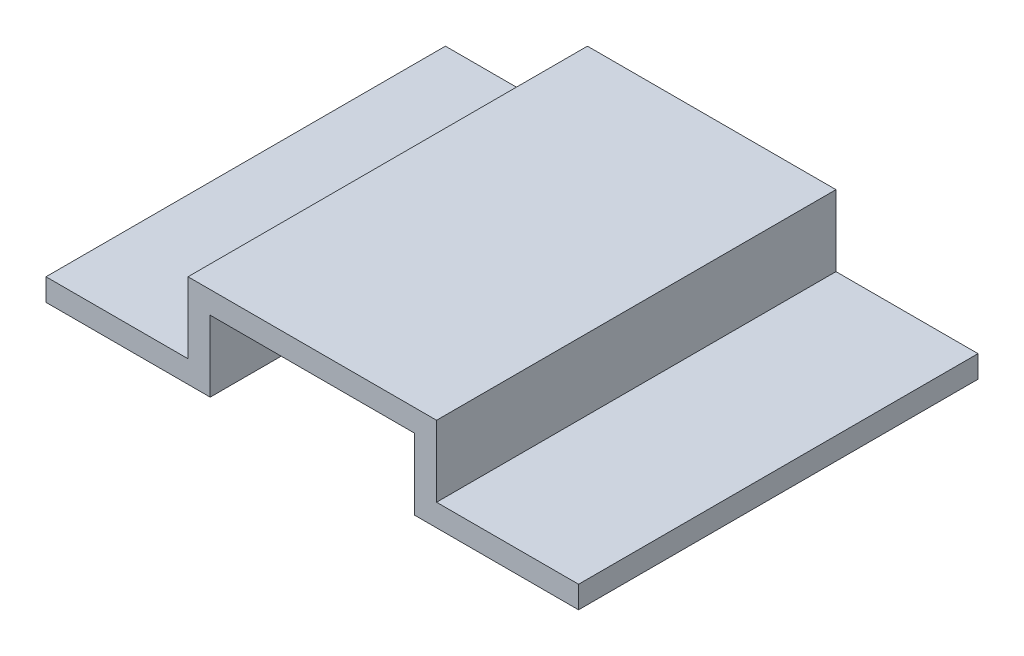
ISO-10303-21;
HEADER;
FILE_DESCRIPTION(('STEP AP214'),'2;1');
FILE_NAME('part.step','',(''),(''),'','','');
FILE_SCHEMA(('AUTOMOTIVE_DESIGN { 1 0 10303 214 1 1 1 1 }'));
ENDSEC;
DATA;
#1=APPLICATION_CONTEXT('core data for automotive mechanical design processes');
#2=APPLICATION_PROTOCOL_DEFINITION('international standard','automotive_design',2000,#1);
#3=PRODUCT_CONTEXT('',#1,'mechanical');
#4=PRODUCT('Part','Part','',(#3));
#5=PRODUCT_RELATED_PRODUCT_CATEGORY('part','',(#4));
#6=PRODUCT_DEFINITION_FORMATION('','',#4);
#7=PRODUCT_DEFINITION_CONTEXT('part definition',#1,'design');
#8=PRODUCT_DEFINITION('design','',#6,#7);
#9=PRODUCT_DEFINITION_SHAPE('','',#8);
#10=(LENGTH_UNIT() NAMED_UNIT(*) SI_UNIT(.MILLI.,.METRE.));
#11=(NAMED_UNIT(*) PLANE_ANGLE_UNIT() SI_UNIT($,.RADIAN.));
#12=(NAMED_UNIT(*) SI_UNIT($,.STERADIAN.) SOLID_ANGLE_UNIT());
#13=UNCERTAINTY_MEASURE_WITH_UNIT(LENGTH_MEASURE(1.E-05),#10,'distance_accuracy_value','');
#14=(GEOMETRIC_REPRESENTATION_CONTEXT(3) GLOBAL_UNCERTAINTY_ASSIGNED_CONTEXT((#13)) GLOBAL_UNIT_ASSIGNED_CONTEXT((#10,
#11,#12)) REPRESENTATION_CONTEXT('',''));
#15=CARTESIAN_POINT('',(0.,0.,0.));
#16=DIRECTION('',(0.,0.,1.));
#17=DIRECTION('',(1.,0.,0.));
#18=AXIS2_PLACEMENT_3D('',#15,#16,#17);
#19=CARTESIAN_POINT('',(210.,25.,450.));
#20=DIRECTION('',(-1.,0.,0.));
#21=DIRECTION('',(0.,-1.,0.));
#22=AXIS2_PLACEMENT_3D('',#19,#20,#21);
#23=PLANE('',#22);
#24=DIRECTION('',(0.,1.,0.));
#25=VECTOR('',#24,1.);
#26=CARTESIAN_POINT('',(210.,25.,0.));
#27=LINE('',#26,#25);
#28=CARTESIAN_POINT('',(210.,25.,0.));
#29=VERTEX_POINT('',#28);
#30=CARTESIAN_POINT('',(210.,105.,0.));
#31=VERTEX_POINT('',#30);
#32=EDGE_CURVE('E157',#29,#31,#27,.T.);
#33=ORIENTED_EDGE('',*,*,#32,.F.);
#34=DIRECTION('',(0.,0.,-1.));
#35=VECTOR('',#34,1.);
#36=CARTESIAN_POINT('',(210.,25.,450.));
#37=LINE('',#36,#35);
#38=CARTESIAN_POINT('',(210.,25.,450.));
#39=VERTEX_POINT('',#38);
#40=EDGE_CURVE('E11',#39,#29,#37,.T.);
#41=ORIENTED_EDGE('',*,*,#40,.F.);
#42=DIRECTION('',(0.,1.,0.));
#43=VECTOR('',#42,1.);
#44=CARTESIAN_POINT('',(210.,25.,450.));
#45=LINE('',#44,#43);
#46=CARTESIAN_POINT('',(210.,105.,450.));
#47=VERTEX_POINT('',#46);
#48=EDGE_CURVE('E187',#39,#47,#45,.T.);
#49=ORIENTED_EDGE('',*,*,#48,.T.);
#50=DIRECTION('',(0.,0.,-1.));
#51=VECTOR('',#50,1.);
#52=CARTESIAN_POINT('',(210.,105.,450.));
#53=LINE('',#52,#51);
#54=EDGE_CURVE('E40',#47,#31,#53,.T.);
#55=ORIENTED_EDGE('',*,*,#54,.T.);
#56=EDGE_LOOP('',(#33,#41,#49,#55));
#57=FACE_BOUND('',#56,.T.);
#58=ADVANCED_FACE('F37',(#57),#23,.T.);
#59=CARTESIAN_POINT('',(50.,25.,450.));
#60=DIRECTION('',(0.,1.,0.));
#61=DIRECTION('',(0.,0.,1.));
#62=AXIS2_PLACEMENT_3D('',#59,#60,#61);
#63=PLANE('',#62);
#64=DIRECTION('',(1.,0.,0.));
#65=VECTOR('',#64,1.);
#66=CARTESIAN_POINT('',(50.,25.,0.));
#67=LINE('',#66,#65);
#68=CARTESIAN_POINT('',(50.,25.,0.));
#69=VERTEX_POINT('',#68);
#70=EDGE_CURVE('E185',#69,#29,#67,.T.);
#71=ORIENTED_EDGE('',*,*,#70,.F.);
#72=DIRECTION('',(0.,0.,-1.));
#73=VECTOR('',#72,1.);
#74=CARTESIAN_POINT('',(50.,25.,450.));
#75=LINE('',#74,#73);
#76=CARTESIAN_POINT('',(50.,25.,450.));
#77=VERTEX_POINT('',#76);
#78=EDGE_CURVE('E46',#77,#69,#75,.T.);
#79=ORIENTED_EDGE('',*,*,#78,.F.);
#80=DIRECTION('',(1.,0.,0.));
#81=VECTOR('',#80,1.);
#82=CARTESIAN_POINT('',(50.,25.,450.));
#83=LINE('',#82,#81);
#84=EDGE_CURVE('E137',#77,#39,#83,.T.);
#85=ORIENTED_EDGE('',*,*,#84,.T.);
#86=ORIENTED_EDGE('',*,*,#40,.T.);
#87=EDGE_LOOP('',(#71,#79,#85,#86));
#88=FACE_BOUND('',#87,.T.);
#89=ADVANCED_FACE('F210',(#88),#63,.T.);
#90=CARTESIAN_POINT('',(50.,25.,450.));
#91=DIRECTION('',(1.,0.,0.));
#92=DIRECTION('',(0.,0.,-1.));
#93=AXIS2_PLACEMENT_3D('',#90,#91,#92);
#94=PLANE('',#93);
#95=DIRECTION('',(0.,-1.,0.));
#96=VECTOR('',#95,1.);
#97=CARTESIAN_POINT('',(50.,25.,0.));
#98=LINE('',#97,#96);
#99=CARTESIAN_POINT('',(50.,0.,0.));
#100=VERTEX_POINT('',#99);
#101=EDGE_CURVE('E142',#69,#100,#98,.T.);
#102=ORIENTED_EDGE('',*,*,#101,.T.);
#103=DIRECTION('',(0.,0.,-1.));
#104=VECTOR('',#103,1.);
#105=CARTESIAN_POINT('',(50.,0.,450.));
#106=LINE('',#105,#104);
#107=CARTESIAN_POINT('',(50.,0.,450.));
#108=VERTEX_POINT('',#107);
#109=EDGE_CURVE('E140',#108,#100,#106,.T.);
#110=ORIENTED_EDGE('',*,*,#109,.F.);
#111=DIRECTION('',(0.,-1.,0.));
#112=VECTOR('',#111,1.);
#113=CARTESIAN_POINT('',(50.,25.,450.));
#114=LINE('',#113,#112);
#115=EDGE_CURVE('E131',#77,#108,#114,.T.);
#116=ORIENTED_EDGE('',*,*,#115,.F.);
#117=ORIENTED_EDGE('',*,*,#78,.T.);
#118=EDGE_LOOP('',(#102,#110,#116,#117));
#119=FACE_BOUND('',#118,.T.);
#120=ADVANCED_FACE('F141',(#119),#94,.F.);
#121=CARTESIAN_POINT('',(50.,0.,450.));
#122=DIRECTION('',(0.,1.,0.));
#123=DIRECTION('',(0.,0.,1.));
#124=AXIS2_PLACEMENT_3D('',#121,#122,#123);
#125=PLANE('',#124);
#126=DIRECTION('',(1.,0.,0.));
#127=VECTOR('',#126,1.);
#128=CARTESIAN_POINT('',(50.,0.,0.));
#129=LINE('',#128,#127);
#130=CARTESIAN_POINT('',(235.,0.,0.));
#131=VERTEX_POINT('',#130);
#132=EDGE_CURVE('E182',#100,#131,#129,.T.);
#133=ORIENTED_EDGE('',*,*,#132,.T.);
#134=DIRECTION('',(0.,0.,-1.));
#135=VECTOR('',#134,1.);
#136=CARTESIAN_POINT('',(235.,0.,450.));
#137=LINE('',#136,#135);
#138=CARTESIAN_POINT('',(235.,0.,450.));
#139=VERTEX_POINT('',#138);
#140=EDGE_CURVE('E145',#139,#131,#137,.T.);
#141=ORIENTED_EDGE('',*,*,#140,.F.);
#142=DIRECTION('',(1.,0.,0.));
#143=VECTOR('',#142,1.);
#144=CARTESIAN_POINT('',(50.,0.,450.));
#145=LINE('',#144,#143);
#146=EDGE_CURVE('E135',#108,#139,#145,.T.);
#147=ORIENTED_EDGE('',*,*,#146,.F.);
#148=ORIENTED_EDGE('',*,*,#109,.T.);
#149=EDGE_LOOP('',(#133,#141,#147,#148));
#150=FACE_BOUND('',#149,.T.);
#151=ADVANCED_FACE('F147',(#150),#125,.F.);
#152=CARTESIAN_POINT('',(235.,0.,450.));
#153=DIRECTION('',(-1.,0.,0.));
#154=DIRECTION('',(0.,0.,1.));
#155=AXIS2_PLACEMENT_3D('',#152,#153,#154);
#156=PLANE('',#155);
#157=DIRECTION('',(0.,1.,0.));
#158=VECTOR('',#157,1.);
#159=CARTESIAN_POINT('',(235.,0.,0.));
#160=LINE('',#159,#158);
#161=CARTESIAN_POINT('',(235.,80.,0.));
#162=VERTEX_POINT('',#161);
#163=EDGE_CURVE('E180',#131,#162,#160,.T.);
#164=ORIENTED_EDGE('',*,*,#163,.T.);
#165=DIRECTION('',(0.,0.,-1.));
#166=VECTOR('',#165,1.);
#167=CARTESIAN_POINT('',(235.,80.,450.));
#168=LINE('',#167,#166);
#169=CARTESIAN_POINT('',(235.,80.,450.));
#170=VERTEX_POINT('',#169);
#171=EDGE_CURVE('E191',#170,#162,#168,.T.);
#172=ORIENTED_EDGE('',*,*,#171,.F.);
#173=DIRECTION('',(0.,1.,0.));
#174=VECTOR('',#173,1.);
#175=CARTESIAN_POINT('',(235.,0.,450.));
#176=LINE('',#175,#174);
#177=EDGE_CURVE('E150',#139,#170,#176,.T.);
#178=ORIENTED_EDGE('',*,*,#177,.F.);
#179=ORIENTED_EDGE('',*,*,#140,.T.);
#180=EDGE_LOOP('',(#164,#172,#178,#179));
#181=FACE_BOUND('',#180,.T.);
#182=ADVANCED_FACE('F223',(#181),#156,.F.);
#183=CARTESIAN_POINT('',(235.,80.,450.));
#184=DIRECTION('',(0.,1.,0.));
#185=DIRECTION('',(0.,0.,1.));
#186=AXIS2_PLACEMENT_3D('',#183,#184,#185);
#187=PLANE('',#186);
#188=DIRECTION('',(1.,0.,0.));
#189=VECTOR('',#188,1.);
#190=CARTESIAN_POINT('',(235.,80.,0.));
#191=LINE('',#190,#189);
#192=CARTESIAN_POINT('',(465.,80.,0.));
#193=VERTEX_POINT('',#192);
#194=EDGE_CURVE('E177',#162,#193,#191,.T.);
#195=ORIENTED_EDGE('',*,*,#194,.T.);
#196=DIRECTION('',(0.,0.,-1.));
#197=VECTOR('',#196,1.);
#198=CARTESIAN_POINT('',(465.,80.,450.));
#199=LINE('',#198,#197);
#200=CARTESIAN_POINT('',(465.,80.,450.));
#201=VERTEX_POINT('',#200);
#202=EDGE_CURVE('E194',#201,#193,#199,.T.);
#203=ORIENTED_EDGE('',*,*,#202,.F.);
#204=DIRECTION('',(1.,0.,0.));
#205=VECTOR('',#204,1.);
#206=CARTESIAN_POINT('',(235.,80.,450.));
#207=LINE('',#206,#205);
#208=EDGE_CURVE('E152',#170,#201,#207,.T.);
#209=ORIENTED_EDGE('',*,*,#208,.F.);
#210=ORIENTED_EDGE('',*,*,#171,.T.);
#211=EDGE_LOOP('',(#195,#203,#209,#210));
#212=FACE_BOUND('',#211,.T.);
#213=ADVANCED_FACE('F226',(#212),#187,.F.);
#214=CARTESIAN_POINT('',(465.,0.,450.));
#215=DIRECTION('',(-1.,0.,0.));
#216=DIRECTION('',(0.,0.,1.));
#217=AXIS2_PLACEMENT_3D('',#214,#215,#216);
#218=PLANE('',#217);
#219=DIRECTION('',(0.,1.,0.));
#220=VECTOR('',#219,1.);
#221=CARTESIAN_POINT('',(465.,0.,0.));
#222=LINE('',#221,#220);
#223=CARTESIAN_POINT('',(465.,0.,0.));
#224=VERTEX_POINT('',#223);
#225=EDGE_CURVE('E174',#224,#193,#222,.T.);
#226=ORIENTED_EDGE('',*,*,#225,.F.);
#227=DIRECTION('',(0.,0.,-1.));
#228=VECTOR('',#227,1.);
#229=CARTESIAN_POINT('',(465.,0.,450.));
#230=LINE('',#229,#228);
#231=CARTESIAN_POINT('',(465.,0.,450.));
#232=VERTEX_POINT('',#231);
#233=EDGE_CURVE('E196',#232,#224,#230,.T.);
#234=ORIENTED_EDGE('',*,*,#233,.F.);
#235=DIRECTION('',(0.,1.,0.));
#236=VECTOR('',#235,1.);
#237=CARTESIAN_POINT('',(465.,0.,450.));
#238=LINE('',#237,#236);
#239=EDGE_CURVE('E352',#232,#201,#238,.T.);
#240=ORIENTED_EDGE('',*,*,#239,.T.);
#241=ORIENTED_EDGE('',*,*,#202,.T.);
#242=EDGE_LOOP('',(#226,#234,#240,#241));
#243=FACE_BOUND('',#242,.T.);
#244=ADVANCED_FACE('F230',(#243),#218,.T.);
#245=CARTESIAN_POINT('',(650.,0.,450.));
#246=DIRECTION('',(0.,-1.,0.));
#247=DIRECTION('',(0.,0.,-1.));
#248=AXIS2_PLACEMENT_3D('',#245,#246,#247);
#249=PLANE('',#248);
#250=DIRECTION('',(-1.,0.,0.));
#251=VECTOR('',#250,1.);
#252=CARTESIAN_POINT('',(650.,0.,0.));
#253=LINE('',#252,#251);
#254=CARTESIAN_POINT('',(650.,0.,0.));
#255=VERTEX_POINT('',#254);
#256=EDGE_CURVE('E171',#255,#224,#253,.T.);
#257=ORIENTED_EDGE('',*,*,#256,.F.);
#258=DIRECTION('',(0.,0.,-1.));
#259=VECTOR('',#258,1.);
#260=CARTESIAN_POINT('',(650.,0.,450.));
#261=LINE('',#260,#259);
#262=CARTESIAN_POINT('',(650.,0.,450.));
#263=VERTEX_POINT('',#262);
#264=EDGE_CURVE('E198',#263,#255,#261,.T.);
#265=ORIENTED_EDGE('',*,*,#264,.F.);
#266=DIRECTION('',(-1.,0.,0.));
#267=VECTOR('',#266,1.);
#268=CARTESIAN_POINT('',(650.,0.,450.));
#269=LINE('',#268,#267);
#270=EDGE_CURVE('E355',#263,#232,#269,.T.);
#271=ORIENTED_EDGE('',*,*,#270,.T.);
#272=ORIENTED_EDGE('',*,*,#233,.T.);
#273=EDGE_LOOP('',(#257,#265,#271,#272));
#274=FACE_BOUND('',#273,.T.);
#275=ADVANCED_FACE('F234',(#274),#249,.T.);
#276=CARTESIAN_POINT('',(650.,25.,450.));
#277=DIRECTION('',(1.,0.,0.));
#278=DIRECTION('',(0.,0.,-1.));
#279=AXIS2_PLACEMENT_3D('',#276,#277,#278);
#280=PLANE('',#279);
#281=DIRECTION('',(0.,-1.,0.));
#282=VECTOR('',#281,1.);
#283=CARTESIAN_POINT('',(650.,25.,0.));
#284=LINE('',#283,#282);
#285=CARTESIAN_POINT('',(650.,25.,0.));
#286=VERTEX_POINT('',#285);
#287=EDGE_CURVE('E168',#286,#255,#284,.T.);
#288=ORIENTED_EDGE('',*,*,#287,.F.);
#289=DIRECTION('',(0.,0.,-1.));
#290=VECTOR('',#289,1.);
#291=CARTESIAN_POINT('',(650.,25.,450.));
#292=LINE('',#291,#290);
#293=CARTESIAN_POINT('',(650.,25.,450.));
#294=VERTEX_POINT('',#293);
#295=EDGE_CURVE('E200',#294,#286,#292,.T.);
#296=ORIENTED_EDGE('',*,*,#295,.F.);
#297=DIRECTION('',(0.,-1.,0.));
#298=VECTOR('',#297,1.);
#299=CARTESIAN_POINT('',(650.,25.,450.));
#300=LINE('',#299,#298);
#301=EDGE_CURVE('E343',#294,#263,#300,.T.);
#302=ORIENTED_EDGE('',*,*,#301,.T.);
#303=ORIENTED_EDGE('',*,*,#264,.T.);
#304=EDGE_LOOP('',(#288,#296,#302,#303));
#305=FACE_BOUND('',#304,.T.);
#306=ADVANCED_FACE('F238',(#305),#280,.T.);
#307=CARTESIAN_POINT('',(650.,25.,450.));
#308=DIRECTION('',(0.,-1.,0.));
#309=DIRECTION('',(0.,0.,-1.));
#310=AXIS2_PLACEMENT_3D('',#307,#308,#309);
#311=PLANE('',#310);
#312=DIRECTION('',(-1.,0.,0.));
#313=VECTOR('',#312,1.);
#314=CARTESIAN_POINT('',(650.,25.,0.));
#315=LINE('',#314,#313);
#316=CARTESIAN_POINT('',(490.,25.,0.));
#317=VERTEX_POINT('',#316);
#318=EDGE_CURVE('E166',#286,#317,#315,.T.);
#319=ORIENTED_EDGE('',*,*,#318,.T.);
#320=DIRECTION('',(0.,0.,-1.));
#321=VECTOR('',#320,1.);
#322=CARTESIAN_POINT('',(490.,25.,450.));
#323=LINE('',#322,#321);
#324=CARTESIAN_POINT('',(490.,25.,450.));
#325=VERTEX_POINT('',#324);
#326=EDGE_CURVE('E202',#325,#317,#323,.T.);
#327=ORIENTED_EDGE('',*,*,#326,.F.);
#328=DIRECTION('',(-1.,0.,0.));
#329=VECTOR('',#328,1.);
#330=CARTESIAN_POINT('',(650.,25.,450.));
#331=LINE('',#330,#329);
#332=EDGE_CURVE('E360',#294,#325,#331,.T.);
#333=ORIENTED_EDGE('',*,*,#332,.F.);
#334=ORIENTED_EDGE('',*,*,#295,.T.);
#335=EDGE_LOOP('',(#319,#327,#333,#334));
#336=FACE_BOUND('',#335,.T.);
#337=ADVANCED_FACE('F242',(#336),#311,.F.);
#338=CARTESIAN_POINT('',(490.,25.,450.));
#339=DIRECTION('',(-1.,0.,0.));
#340=DIRECTION('',(0.,-1.,0.));
#341=AXIS2_PLACEMENT_3D('',#338,#339,#340);
#342=PLANE('',#341);
#343=DIRECTION('',(0.,1.,0.));
#344=VECTOR('',#343,1.);
#345=CARTESIAN_POINT('',(490.,25.,0.));
#346=LINE('',#345,#344);
#347=CARTESIAN_POINT('',(490.,105.,0.));
#348=VERTEX_POINT('',#347);
#349=EDGE_CURVE('E163',#317,#348,#346,.T.);
#350=ORIENTED_EDGE('',*,*,#349,.T.);
#351=DIRECTION('',(0.,0.,-1.));
#352=VECTOR('',#351,1.);
#353=CARTESIAN_POINT('',(490.,105.,450.));
#354=LINE('',#353,#352);
#355=CARTESIAN_POINT('',(490.,105.,450.));
#356=VERTEX_POINT('',#355);
#357=EDGE_CURVE('E204',#356,#348,#354,.T.);
#358=ORIENTED_EDGE('',*,*,#357,.F.);
#359=DIRECTION('',(0.,1.,0.));
#360=VECTOR('',#359,1.);
#361=CARTESIAN_POINT('',(490.,25.,450.));
#362=LINE('',#361,#360);
#363=EDGE_CURVE('E362',#325,#356,#362,.T.);
#364=ORIENTED_EDGE('',*,*,#363,.F.);
#365=ORIENTED_EDGE('',*,*,#326,.T.);
#366=EDGE_LOOP('',(#350,#358,#364,#365));
#367=FACE_BOUND('',#366,.T.);
#368=ADVANCED_FACE('F246',(#367),#342,.F.);
#369=CARTESIAN_POINT('',(210.,105.,450.));
#370=DIRECTION('',(0.,1.,0.));
#371=DIRECTION('',(0.,0.,1.));
#372=AXIS2_PLACEMENT_3D('',#369,#370,#371);
#373=PLANE('',#372);
#374=DIRECTION('',(1.,0.,0.));
#375=VECTOR('',#374,1.);
#376=CARTESIAN_POINT('',(210.,105.,0.));
#377=LINE('',#376,#375);
#378=EDGE_CURVE('E160',#31,#348,#377,.T.);
#379=ORIENTED_EDGE('',*,*,#378,.F.);
#380=ORIENTED_EDGE('',*,*,#54,.F.);
#381=DIRECTION('',(1.,0.,0.));
#382=VECTOR('',#381,1.);
#383=CARTESIAN_POINT('',(210.,105.,450.));
#384=LINE('',#383,#382);
#385=EDGE_CURVE('E364',#47,#356,#384,.T.);
#386=ORIENTED_EDGE('',*,*,#385,.T.);
#387=ORIENTED_EDGE('',*,*,#357,.T.);
#388=EDGE_LOOP('',(#379,#380,#386,#387));
#389=FACE_BOUND('',#388,.T.);
#390=ADVANCED_FACE('F206',(#389),#373,.T.);
#391=CARTESIAN_POINT('',(0.,0.,450.));
#392=DIRECTION('',(0.,0.,-1.));
#393=DIRECTION('',(-1.,0.,0.));
#394=AXIS2_PLACEMENT_3D('',#391,#392,#393);
#395=PLANE('',#394);
#396=ORIENTED_EDGE('',*,*,#48,.F.);
#397=ORIENTED_EDGE('',*,*,#84,.F.);
#398=ORIENTED_EDGE('',*,*,#115,.T.);
#399=ORIENTED_EDGE('',*,*,#146,.T.);
#400=ORIENTED_EDGE('',*,*,#177,.T.);
#401=ORIENTED_EDGE('',*,*,#208,.T.);
#402=ORIENTED_EDGE('',*,*,#239,.F.);
#403=ORIENTED_EDGE('',*,*,#270,.F.);
#404=ORIENTED_EDGE('',*,*,#301,.F.);
#405=ORIENTED_EDGE('',*,*,#332,.T.);
#406=ORIENTED_EDGE('',*,*,#363,.T.);
#407=ORIENTED_EDGE('',*,*,#385,.F.);
#408=EDGE_LOOP('',(#396,#397,#398,#399,#400,#401,#402,#403,#404,#405,#406,#407));
#409=FACE_BOUND('',#408,.T.);
#410=ADVANCED_FACE('F133',(#409),#395,.F.);
#411=CARTESIAN_POINT('',(0.,0.,0.));
#412=DIRECTION('',(0.,0.,-1.));
#413=DIRECTION('',(-1.,0.,0.));
#414=AXIS2_PLACEMENT_3D('',#411,#412,#413);
#415=PLANE('',#414);
#416=ORIENTED_EDGE('',*,*,#32,.T.);
#417=ORIENTED_EDGE('',*,*,#378,.T.);
#418=ORIENTED_EDGE('',*,*,#349,.F.);
#419=ORIENTED_EDGE('',*,*,#318,.F.);
#420=ORIENTED_EDGE('',*,*,#287,.T.);
#421=ORIENTED_EDGE('',*,*,#256,.T.);
#422=ORIENTED_EDGE('',*,*,#225,.T.);
#423=ORIENTED_EDGE('',*,*,#194,.F.);
#424=ORIENTED_EDGE('',*,*,#163,.F.);
#425=ORIENTED_EDGE('',*,*,#132,.F.);
#426=ORIENTED_EDGE('',*,*,#101,.F.);
#427=ORIENTED_EDGE('',*,*,#70,.T.);
#428=EDGE_LOOP('',(#416,#417,#418,#419,#420,#421,#422,#423,#424,#425,#426,#427));
#429=FACE_BOUND('',#428,.T.);
#430=ADVANCED_FACE('F209',(#429),#415,.T.);
#431=CLOSED_SHELL('',(#58,#89,#120,#151,#182,#213,#244,#275,#306,#337,#368,#390,#410,#430));
#432=MANIFOLD_SOLID_BREP('B2',#431);
#433=ADVANCED_BREP_SHAPE_REPRESENTATION('',(#18,#432),#14);
#434=SHAPE_DEFINITION_REPRESENTATION(#9,#433);
ENDSEC;
END-ISO-10303-21;
